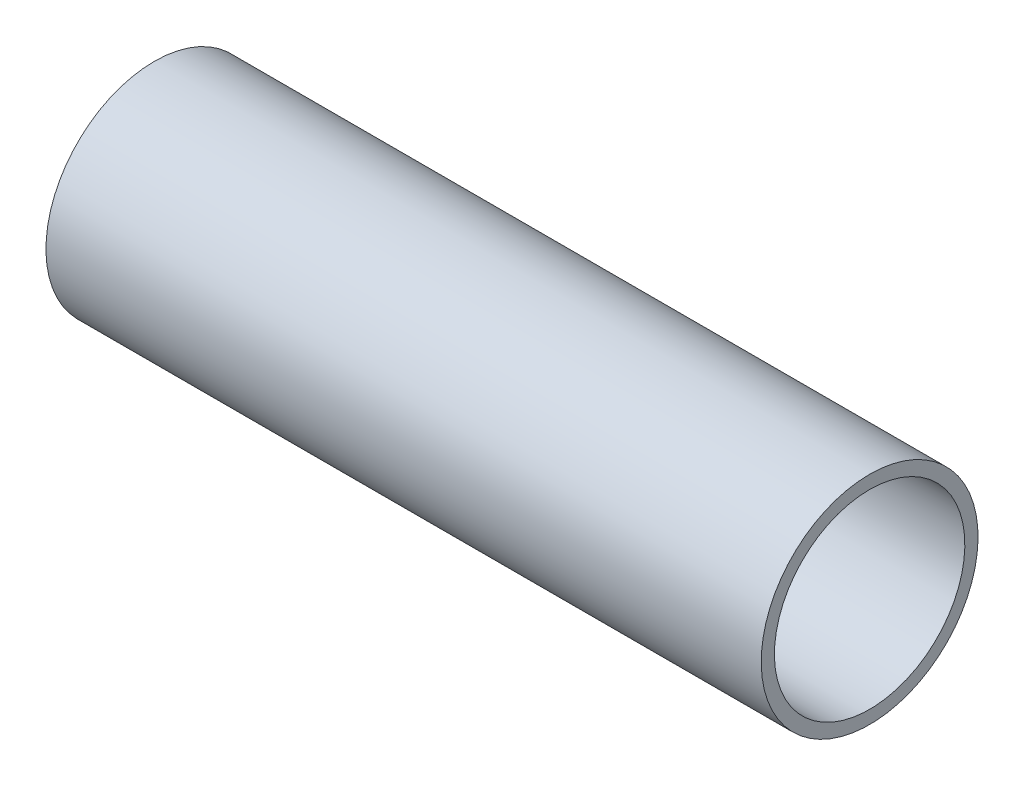
ISO-10303-21;
HEADER;
FILE_DESCRIPTION(('STEP AP214'),'2;1');
FILE_NAME('part.step','',(''),(''),'','','');
FILE_SCHEMA(('AUTOMOTIVE_DESIGN { 1 0 10303 214 1 1 1 1 }'));
ENDSEC;
DATA;
#1=APPLICATION_CONTEXT('core data for automotive mechanical design processes');
#2=APPLICATION_PROTOCOL_DEFINITION('international standard','automotive_design',2000,#1);
#3=PRODUCT_CONTEXT('',#1,'mechanical');
#4=PRODUCT('Part','Part','',(#3));
#5=PRODUCT_RELATED_PRODUCT_CATEGORY('part','',(#4));
#6=PRODUCT_DEFINITION_FORMATION('','',#4);
#7=PRODUCT_DEFINITION_CONTEXT('part definition',#1,'design');
#8=PRODUCT_DEFINITION('design','',#6,#7);
#9=PRODUCT_DEFINITION_SHAPE('','',#8);
#10=(LENGTH_UNIT() NAMED_UNIT(*) SI_UNIT(.MILLI.,.METRE.));
#11=(NAMED_UNIT(*) PLANE_ANGLE_UNIT() SI_UNIT($,.RADIAN.));
#12=(NAMED_UNIT(*) SI_UNIT($,.STERADIAN.) SOLID_ANGLE_UNIT());
#13=UNCERTAINTY_MEASURE_WITH_UNIT(LENGTH_MEASURE(1.E-05),#10,'distance_accuracy_value','');
#14=(GEOMETRIC_REPRESENTATION_CONTEXT(3) GLOBAL_UNCERTAINTY_ASSIGNED_CONTEXT((#13)) GLOBAL_UNIT_ASSIGNED_CONTEXT((#10,
#11,#12)) REPRESENTATION_CONTEXT('',''));
#15=CARTESIAN_POINT('',(0.,0.,0.));
#16=DIRECTION('',(0.,0.,1.));
#17=DIRECTION('',(1.,0.,0.));
#18=AXIS2_PLACEMENT_3D('',#15,#16,#17);
#19=CARTESIAN_POINT('',(27.5,0.,0.));
#20=DIRECTION('',(1.,0.,0.));
#21=DIRECTION('',(0.,1.,0.));
#22=AXIS2_PLACEMENT_3D('',#19,#20,#21);
#23=CYLINDRICAL_SURFACE('',#22,21.3);
#24=CARTESIAN_POINT('',(132.5,0.,0.));
#25=DIRECTION('',(1.,0.,0.));
#26=DIRECTION('',(0.,1.,0.));
#27=AXIS2_PLACEMENT_3D('',#24,#25,#26);
#28=CIRCLE('',#27,21.3);
#29=CARTESIAN_POINT('',(132.5,21.3,0.));
#30=VERTEX_POINT('',#29);
#31=EDGE_CURVE('E51',#30,#30,#28,.T.);
#32=ORIENTED_EDGE('',*,*,#31,.T.);
#33=EDGE_LOOP('',(#32));
#34=FACE_BOUND('',#33,.T.);
#35=CARTESIAN_POINT('',(-27.5,0.,0.));
#36=DIRECTION('',(1.,0.,0.));
#37=DIRECTION('',(0.,1.,0.));
#38=AXIS2_PLACEMENT_3D('',#35,#36,#37);
#39=CIRCLE('',#38,21.3);
#40=CARTESIAN_POINT('',(-27.5,21.3,0.));
#41=VERTEX_POINT('',#40);
#42=EDGE_CURVE('E10',#41,#41,#39,.T.);
#43=ORIENTED_EDGE('',*,*,#42,.F.);
#44=EDGE_LOOP('',(#43));
#45=FACE_BOUND('',#44,.T.);
#46=ADVANCED_FACE('F37',(#34,#45),#23,.F.);
#47=CARTESIAN_POINT('',(-27.5,21.3,0.));
#48=DIRECTION('',(-1.,0.,0.));
#49=DIRECTION('',(0.,-1.,0.));
#50=AXIS2_PLACEMENT_3D('',#47,#48,#49);
#51=PLANE('',#50);
#52=ORIENTED_EDGE('',*,*,#42,.T.);
#53=EDGE_LOOP('',(#52));
#54=FACE_BOUND('',#53,.T.);
#55=CARTESIAN_POINT('',(-27.5,0.,0.));
#56=DIRECTION('',(1.,0.,0.));
#57=DIRECTION('',(0.,1.,0.));
#58=AXIS2_PLACEMENT_3D('',#55,#56,#57);
#59=CIRCLE('',#58,24.25);
#60=CARTESIAN_POINT('',(-27.5,24.25,0.));
#61=VERTEX_POINT('',#60);
#62=EDGE_CURVE('E43',#61,#61,#59,.T.);
#63=ORIENTED_EDGE('',*,*,#62,.F.);
#64=EDGE_LOOP('',(#63));
#65=FACE_BOUND('',#64,.T.);
#66=ADVANCED_FACE('F67',(#54,#65),#51,.T.);
#67=CARTESIAN_POINT('',(27.5,0.,0.));
#68=DIRECTION('',(1.,0.,0.));
#69=DIRECTION('',(0.,1.,0.));
#70=AXIS2_PLACEMENT_3D('',#67,#68,#69);
#71=CYLINDRICAL_SURFACE('',#70,24.25);
#72=ORIENTED_EDGE('',*,*,#62,.T.);
#73=EDGE_LOOP('',(#72));
#74=FACE_BOUND('',#73,.T.);
#75=CARTESIAN_POINT('',(132.5,0.,0.));
#76=DIRECTION('',(1.,0.,0.));
#77=DIRECTION('',(0.,1.,0.));
#78=AXIS2_PLACEMENT_3D('',#75,#76,#77);
#79=CIRCLE('',#78,24.25);
#80=CARTESIAN_POINT('',(132.5,24.25,0.));
#81=VERTEX_POINT('',#80);
#82=EDGE_CURVE('E47',#81,#81,#79,.T.);
#83=ORIENTED_EDGE('',*,*,#82,.F.);
#84=EDGE_LOOP('',(#83));
#85=FACE_BOUND('',#84,.T.);
#86=ADVANCED_FACE('F61',(#74,#85),#71,.T.);
#87=CARTESIAN_POINT('',(132.5,24.25,0.));
#88=DIRECTION('',(1.,0.,0.));
#89=DIRECTION('',(0.,1.,0.));
#90=AXIS2_PLACEMENT_3D('',#87,#88,#89);
#91=PLANE('',#90);
#92=ORIENTED_EDGE('',*,*,#82,.T.);
#93=EDGE_LOOP('',(#92));
#94=FACE_BOUND('',#93,.T.);
#95=ORIENTED_EDGE('',*,*,#31,.F.);
#96=EDGE_LOOP('',(#95));
#97=FACE_BOUND('',#96,.T.);
#98=ADVANCED_FACE('F59',(#94,#97),#91,.T.);
#99=CLOSED_SHELL('',(#46,#66,#86,#98));
#100=MANIFOLD_SOLID_BREP('B2',#99);
#101=ADVANCED_BREP_SHAPE_REPRESENTATION('',(#18,#100),#14);
#102=SHAPE_DEFINITION_REPRESENTATION(#9,#101);
ENDSEC;
END-ISO-10303-21;
